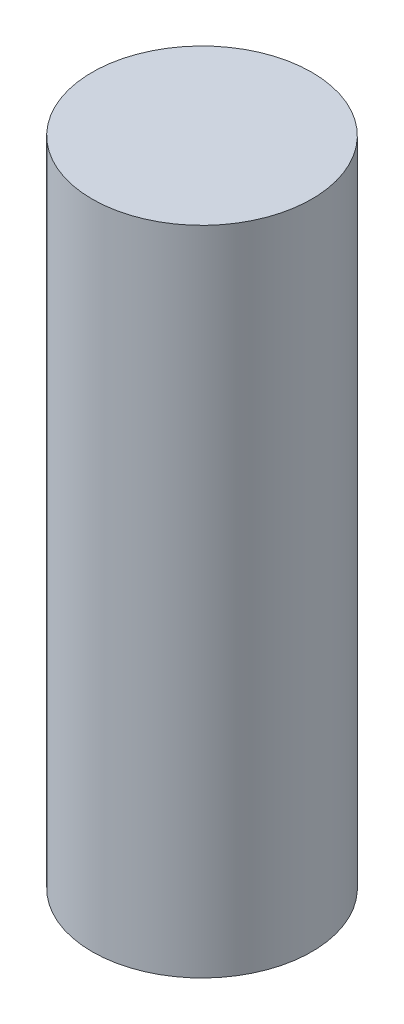
ISO-10303-21;
HEADER;
FILE_DESCRIPTION(('STEP AP214'),'2;1');
FILE_NAME('part.step','',(''),(''),'','','');
FILE_SCHEMA(('AUTOMOTIVE_DESIGN { 1 0 10303 214 1 1 1 1 }'));
ENDSEC;
DATA;
#1=APPLICATION_CONTEXT('core data for automotive mechanical design processes');
#2=APPLICATION_PROTOCOL_DEFINITION('international standard','automotive_design',2000,#1);
#3=PRODUCT_CONTEXT('',#1,'mechanical');
#4=PRODUCT('Part','Part','',(#3));
#5=PRODUCT_RELATED_PRODUCT_CATEGORY('part','',(#4));
#6=PRODUCT_DEFINITION_FORMATION('','',#4);
#7=PRODUCT_DEFINITION_CONTEXT('part definition',#1,'design');
#8=PRODUCT_DEFINITION('design','',#6,#7);
#9=PRODUCT_DEFINITION_SHAPE('','',#8);
#10=(LENGTH_UNIT() NAMED_UNIT(*) SI_UNIT(.MILLI.,.METRE.));
#11=(NAMED_UNIT(*) PLANE_ANGLE_UNIT() SI_UNIT($,.RADIAN.));
#12=(NAMED_UNIT(*) SI_UNIT($,.STERADIAN.) SOLID_ANGLE_UNIT());
#13=UNCERTAINTY_MEASURE_WITH_UNIT(LENGTH_MEASURE(1.E-05),#10,'distance_accuracy_value','');
#14=(GEOMETRIC_REPRESENTATION_CONTEXT(3) GLOBAL_UNCERTAINTY_ASSIGNED_CONTEXT((#13)) GLOBAL_UNIT_ASSIGNED_CONTEXT((#10,
#11,#12)) REPRESENTATION_CONTEXT('',''));
#15=CARTESIAN_POINT('',(0.,0.,0.));
#16=DIRECTION('',(0.,0.,1.));
#17=DIRECTION('',(1.,0.,0.));
#18=AXIS2_PLACEMENT_3D('',#15,#16,#17);
#19=CARTESIAN_POINT('',(0.,17.8,0.));
#20=DIRECTION('',(0.,-1.,0.));
#21=DIRECTION('',(0.,0.,-1.));
#22=AXIS2_PLACEMENT_3D('',#19,#20,#21);
#23=CYLINDRICAL_SURFACE('',#22,3.);
#24=CARTESIAN_POINT('',(0.,17.8,0.));
#25=DIRECTION('',(0.,1.,0.));
#26=DIRECTION('',(0.,0.,1.));
#27=AXIS2_PLACEMENT_3D('',#24,#25,#26);
#28=CIRCLE('',#27,3.);
#29=CARTESIAN_POINT('',(0.,17.8,3.));
#30=VERTEX_POINT('',#29);
#31=EDGE_CURVE('E10',#30,#30,#28,.T.);
#32=ORIENTED_EDGE('',*,*,#31,.F.);
#33=EDGE_LOOP('',(#32));
#34=FACE_BOUND('',#33,.T.);
#35=CARTESIAN_POINT('',(0.,0.,0.));
#36=DIRECTION('',(0.,1.,0.));
#37=DIRECTION('',(0.,0.,1.));
#38=AXIS2_PLACEMENT_3D('',#35,#36,#37);
#39=CIRCLE('',#38,3.);
#40=CARTESIAN_POINT('',(0.,0.,3.));
#41=VERTEX_POINT('',#40);
#42=EDGE_CURVE('E40',#41,#41,#39,.T.);
#43=ORIENTED_EDGE('',*,*,#42,.T.);
#44=EDGE_LOOP('',(#43));
#45=FACE_BOUND('',#44,.T.);
#46=ADVANCED_FACE('F37',(#34,#45),#23,.T.);
#47=CARTESIAN_POINT('',(0.,17.8,0.));
#48=DIRECTION('',(0.,1.,0.));
#49=DIRECTION('',(0.,0.,1.));
#50=AXIS2_PLACEMENT_3D('',#47,#48,#49);
#51=PLANE('',#50);
#52=ORIENTED_EDGE('',*,*,#31,.T.);
#53=EDGE_LOOP('',(#52));
#54=FACE_BOUND('',#53,.T.);
#55=ADVANCED_FACE('F54',(#54),#51,.T.);
#56=CARTESIAN_POINT('',(0.,0.,0.));
#57=DIRECTION('',(0.,1.,0.));
#58=DIRECTION('',(0.,0.,1.));
#59=AXIS2_PLACEMENT_3D('',#56,#57,#58);
#60=PLANE('',#59);
#61=ORIENTED_EDGE('',*,*,#42,.F.);
#62=EDGE_LOOP('',(#61));
#63=FACE_BOUND('',#62,.T.);
#64=ADVANCED_FACE('F52',(#63),#60,.F.);
#65=CLOSED_SHELL('',(#46,#55,#64));
#66=MANIFOLD_SOLID_BREP('B2',#65);
#67=ADVANCED_BREP_SHAPE_REPRESENTATION('',(#18,#66),#14);
#68=SHAPE_DEFINITION_REPRESENTATION(#9,#67);
ENDSEC;
END-ISO-10303-21;
